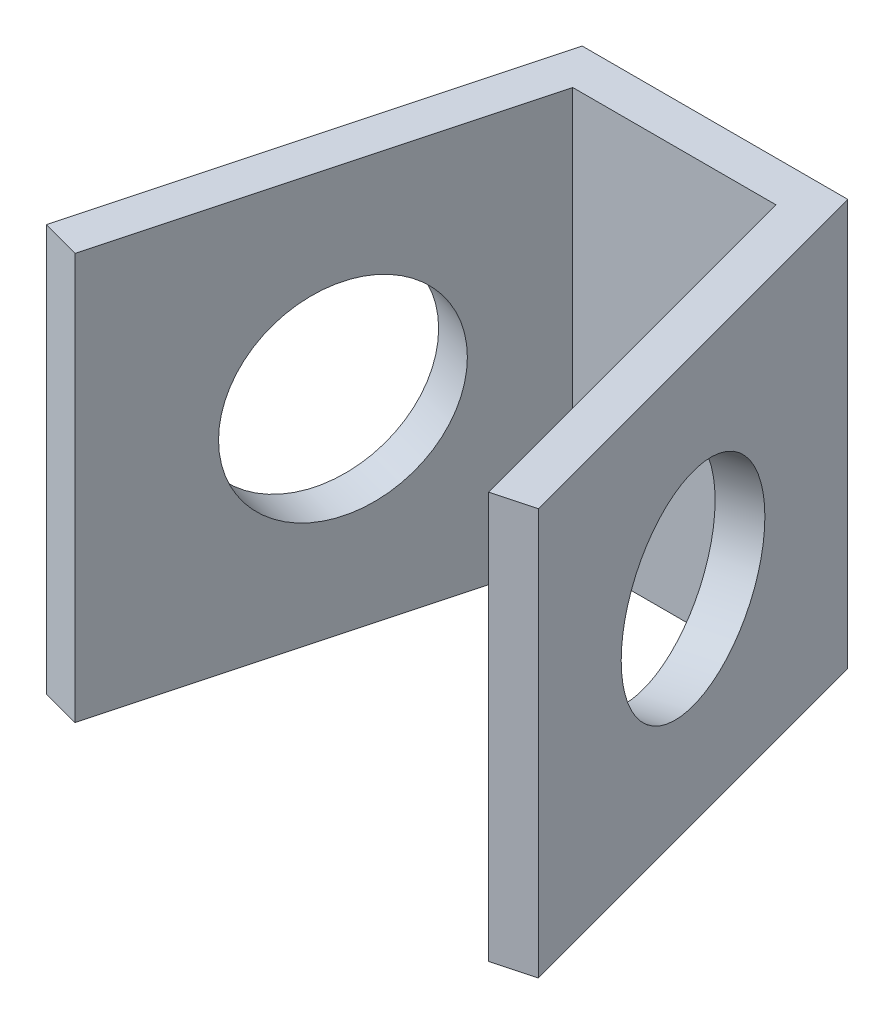
ISO-10303-21;
HEADER;
FILE_DESCRIPTION(('STEP AP214'),'2;1');
FILE_NAME('part.step','',(''),(''),'','','');
FILE_SCHEMA(('AUTOMOTIVE_DESIGN { 1 0 10303 214 1 1 1 1 }'));
ENDSEC;
DATA;
#1=APPLICATION_CONTEXT('core data for automotive mechanical design processes');
#2=APPLICATION_PROTOCOL_DEFINITION('international standard','automotive_design',2000,#1);
#3=PRODUCT_CONTEXT('',#1,'mechanical');
#4=PRODUCT('Part','Part','',(#3));
#5=PRODUCT_RELATED_PRODUCT_CATEGORY('part','',(#4));
#6=PRODUCT_DEFINITION_FORMATION('','',#4);
#7=PRODUCT_DEFINITION_CONTEXT('part definition',#1,'design');
#8=PRODUCT_DEFINITION('design','',#6,#7);
#9=PRODUCT_DEFINITION_SHAPE('','',#8);
#10=(LENGTH_UNIT() NAMED_UNIT(*) SI_UNIT(.MILLI.,.METRE.));
#11=(NAMED_UNIT(*) PLANE_ANGLE_UNIT() SI_UNIT($,.RADIAN.));
#12=(NAMED_UNIT(*) SI_UNIT($,.STERADIAN.) SOLID_ANGLE_UNIT());
#13=UNCERTAINTY_MEASURE_WITH_UNIT(LENGTH_MEASURE(1.E-05),#10,'distance_accuracy_value','');
#14=(GEOMETRIC_REPRESENTATION_CONTEXT(3) GLOBAL_UNCERTAINTY_ASSIGNED_CONTEXT((#13)) GLOBAL_UNIT_ASSIGNED_CONTEXT((#10,
#11,#12)) REPRESENTATION_CONTEXT('',''));
#15=CARTESIAN_POINT('',(0.,0.,0.));
#16=DIRECTION('',(0.,0.,1.));
#17=DIRECTION('',(1.,0.,0.));
#18=AXIS2_PLACEMENT_3D('',#15,#16,#17);
#19=CARTESIAN_POINT('',(-12.1082325546286,10.,18.8008784355763));
#20=DIRECTION('',(0.965925826289068,0.,0.258819045102521));
#21=DIRECTION('',(0.258819045102521,0.,-0.965925826289068));
#22=AXIS2_PLACEMENT_3D('',#19,#20,#21);
#23=PLANE('',#22);
#24=DIRECTION('',(-0.258819045102521,0.,0.965925826289068));
#25=VECTOR('',#24,1.);
#26=CARTESIAN_POINT('',(-12.1082325546286,-10.,18.8008784355763));
#27=LINE('',#26,#25);
#28=CARTESIAN_POINT('',(-6.53465397595792,-10.,-2.));
#29=VERTEX_POINT('',#28);
#30=CARTESIAN_POINT('',(-12.1082325546286,-10.,18.8008784355763));
#31=VERTEX_POINT('',#30);
#32=EDGE_CURVE('E122',#29,#31,#27,.T.);
#33=ORIENTED_EDGE('',*,*,#32,.T.);
#34=DIRECTION('',(0.,-1.,0.));
#35=VECTOR('',#34,1.);
#36=CARTESIAN_POINT('',(-12.1082325546286,10.,18.8008784355763));
#37=LINE('',#36,#35);
#38=CARTESIAN_POINT('',(-12.1082325546286,10.,18.8008784355763));
#39=VERTEX_POINT('',#38);
#40=EDGE_CURVE('E119',#39,#31,#37,.T.);
#41=ORIENTED_EDGE('',*,*,#40,.F.);
#42=DIRECTION('',(-0.258819045102521,0.,0.965925826289068));
#43=VECTOR('',#42,1.);
#44=CARTESIAN_POINT('',(-12.1082325546286,10.,18.8008784355763));
#45=LINE('',#44,#43);
#46=CARTESIAN_POINT('',(-6.53465397595792,10.,-2.));
#47=VERTEX_POINT('',#46);
#48=EDGE_CURVE('E108',#47,#39,#45,.T.);
#49=ORIENTED_EDGE('',*,*,#48,.F.);
#50=DIRECTION('',(0.,-1.,0.));
#51=VECTOR('',#50,1.);
#52=CARTESIAN_POINT('',(-6.53465397595792,10.,-2.));
#53=LINE('',#52,#51);
#54=EDGE_CURVE('E123',#47,#29,#53,.T.);
#55=ORIENTED_EDGE('',*,*,#54,.T.);
#56=EDGE_LOOP('',(#33,#41,#49,#55));
#57=FACE_BOUND('',#56,.T.);
#58=CARTESIAN_POINT('',(-9.32144326529324,0.,8.40043921778816));
#59=DIRECTION('',(0.965925826289068,0.,0.258819045102521));
#60=DIRECTION('',(0.258819045102521,0.,-0.965925826289068));
#61=AXIS2_PLACEMENT_3D('',#58,#59,#60);
#62=CIRCLE('',#61,5.);
#63=CARTESIAN_POINT('',(-8.02734803978064,0.,3.57081008634282));
#64=VERTEX_POINT('',#63);
#65=EDGE_CURVE('E186',#64,#64,#62,.T.);
#66=ORIENTED_EDGE('',*,*,#65,.T.);
#67=EDGE_LOOP('',(#66));
#68=FACE_BOUND('',#67,.T.);
#69=ADVANCED_FACE('F35',(#57,#68),#23,.F.);
#70=CARTESIAN_POINT('',(-5.,10.,0.));
#71=DIRECTION('',(-0.965925826289068,0.,-0.258819045102521));
#72=DIRECTION('',(-0.258819045102521,0.,0.965925826289068));
#73=AXIS2_PLACEMENT_3D('',#70,#71,#72);
#74=PLANE('',#73);
#75=DIRECTION('',(0.258819045102521,0.,-0.965925826289068));
#76=VECTOR('',#75,1.);
#77=CARTESIAN_POINT('',(-5.,-10.,0.));
#78=LINE('',#77,#76);
#79=CARTESIAN_POINT('',(-10.1763809020504,-10.,19.3185165257814));
#80=VERTEX_POINT('',#79);
#81=CARTESIAN_POINT('',(-5.,-10.,0.));
#82=VERTEX_POINT('',#81);
#83=EDGE_CURVE('E87',#80,#82,#78,.T.);
#84=ORIENTED_EDGE('',*,*,#83,.T.);
#85=DIRECTION('',(0.,-1.,0.));
#86=VECTOR('',#85,1.);
#87=CARTESIAN_POINT('',(-5.,10.,0.));
#88=LINE('',#87,#86);
#89=CARTESIAN_POINT('',(-5.,10.,0.));
#90=VERTEX_POINT('',#89);
#91=EDGE_CURVE('E128',#90,#82,#88,.T.);
#92=ORIENTED_EDGE('',*,*,#91,.F.);
#93=DIRECTION('',(0.258819045102521,0.,-0.965925826289068));
#94=VECTOR('',#93,1.);
#95=CARTESIAN_POINT('',(-5.,10.,0.));
#96=LINE('',#95,#94);
#97=CARTESIAN_POINT('',(-10.1763809020504,10.,19.3185165257814));
#98=VERTEX_POINT('',#97);
#99=EDGE_CURVE('E52',#98,#90,#96,.T.);
#100=ORIENTED_EDGE('',*,*,#99,.F.);
#101=DIRECTION('',(0.,-1.,0.));
#102=VECTOR('',#101,1.);
#103=CARTESIAN_POINT('',(-10.1763809020504,10.,19.3185165257814));
#104=LINE('',#103,#102);
#105=EDGE_CURVE('E124',#98,#80,#104,.T.);
#106=ORIENTED_EDGE('',*,*,#105,.T.);
#107=EDGE_LOOP('',(#84,#92,#100,#106));
#108=FACE_BOUND('',#107,.T.);
#109=CARTESIAN_POINT('',(-7.38959161271511,0.,8.9180773079932));
#110=DIRECTION('',(-0.965925826289068,0.,-0.258819045102521));
#111=DIRECTION('',(-0.258819045102521,0.,0.965925826289068));
#112=AXIS2_PLACEMENT_3D('',#109,#110,#111);
#113=CIRCLE('',#112,5.);
#114=CARTESIAN_POINT('',(-8.68368683822771,0.,13.7477064394385));
#115=VERTEX_POINT('',#114);
#116=EDGE_CURVE('E183',#115,#115,#113,.T.);
#117=ORIENTED_EDGE('',*,*,#116,.T.);
#118=EDGE_LOOP('',(#117));
#119=FACE_BOUND('',#118,.T.);
#120=ADVANCED_FACE('F192',(#108,#119),#74,.F.);
#121=CARTESIAN_POINT('',(-5.,10.,0.));
#122=DIRECTION('',(0.,0.,-1.));
#123=DIRECTION('',(-1.,0.,0.));
#124=AXIS2_PLACEMENT_3D('',#121,#122,#123);
#125=PLANE('',#124);
#126=DIRECTION('',(1.,0.,0.));
#127=VECTOR('',#126,1.);
#128=CARTESIAN_POINT('',(-5.,-10.,0.));
#129=LINE('',#128,#127);
#130=CARTESIAN_POINT('',(5.,-10.,0.));
#131=VERTEX_POINT('',#130);
#132=EDGE_CURVE('E132',#82,#131,#129,.T.);
#133=ORIENTED_EDGE('',*,*,#132,.T.);
#134=DIRECTION('',(0.,-1.,0.));
#135=VECTOR('',#134,1.);
#136=CARTESIAN_POINT('',(5.,10.,0.));
#137=LINE('',#136,#135);
#138=CARTESIAN_POINT('',(5.,10.,0.));
#139=VERTEX_POINT('',#138);
#140=EDGE_CURVE('E11',#139,#131,#137,.T.);
#141=ORIENTED_EDGE('',*,*,#140,.F.);
#142=DIRECTION('',(1.,0.,0.));
#143=VECTOR('',#142,1.);
#144=CARTESIAN_POINT('',(-5.,10.,0.));
#145=LINE('',#144,#143);
#146=EDGE_CURVE('E147',#90,#139,#145,.T.);
#147=ORIENTED_EDGE('',*,*,#146,.F.);
#148=ORIENTED_EDGE('',*,*,#91,.T.);
#149=EDGE_LOOP('',(#133,#141,#147,#148));
#150=FACE_BOUND('',#149,.T.);
#151=ADVANCED_FACE('F37',(#150),#125,.F.);
#152=CARTESIAN_POINT('',(5.,10.,0.));
#153=DIRECTION('',(0.965925826289068,0.,-0.258819045102522));
#154=DIRECTION('',(-0.258819045102522,0.,-0.965925826289068));
#155=AXIS2_PLACEMENT_3D('',#152,#153,#154);
#156=PLANE('',#155);
#157=CARTESIAN_POINT('',(7.38959161271511,0.,8.9180773079932));
#158=DIRECTION('',(0.965925826289068,0.,-0.258819045102522));
#159=DIRECTION('',(-0.258819045102522,0.,-0.965925826289068));
#160=AXIS2_PLACEMENT_3D('',#157,#158,#159);
#161=CIRCLE('',#160,5.);
#162=CARTESIAN_POINT('',(6.0954963872025,0.,4.08844817654786));
#163=VERTEX_POINT('',#162);
#164=EDGE_CURVE('E136',#163,#163,#161,.F.);
#165=ORIENTED_EDGE('',*,*,#164,.F.);
#166=EDGE_LOOP('',(#165));
#167=FACE_BOUND('',#166,.T.);
#168=DIRECTION('',(0.258819045102522,0.,0.965925826289068));
#169=VECTOR('',#168,1.);
#170=CARTESIAN_POINT('',(5.,-10.,0.));
#171=LINE('',#170,#169);
#172=CARTESIAN_POINT('',(10.1763809020504,-10.,19.3185165257814));
#173=VERTEX_POINT('',#172);
#174=EDGE_CURVE('E135',#131,#173,#171,.T.);
#175=ORIENTED_EDGE('',*,*,#174,.T.);
#176=DIRECTION('',(0.,-1.,0.));
#177=VECTOR('',#176,1.);
#178=CARTESIAN_POINT('',(10.1763809020504,10.,19.3185165257814));
#179=LINE('',#178,#177);
#180=CARTESIAN_POINT('',(10.1763809020504,10.,19.3185165257814));
#181=VERTEX_POINT('',#180);
#182=EDGE_CURVE('E44',#181,#173,#179,.T.);
#183=ORIENTED_EDGE('',*,*,#182,.F.);
#184=DIRECTION('',(0.258819045102522,0.,0.965925826289068));
#185=VECTOR('',#184,1.);
#186=CARTESIAN_POINT('',(5.,10.,0.));
#187=LINE('',#186,#185);
#188=EDGE_CURVE('E95',#139,#181,#187,.T.);
#189=ORIENTED_EDGE('',*,*,#188,.F.);
#190=ORIENTED_EDGE('',*,*,#140,.T.);
#191=EDGE_LOOP('',(#175,#183,#189,#190));
#192=FACE_BOUND('',#191,.T.);
#193=ADVANCED_FACE('F220',(#167,#192),#156,.F.);
#194=CARTESIAN_POINT('',(10.1763809020504,10.,19.3185165257814));
#195=DIRECTION('',(-0.258819045102523,0.,-0.965925826289068));
#196=DIRECTION('',(-0.965925826289068,0.,0.258819045102524));
#197=AXIS2_PLACEMENT_3D('',#194,#195,#196);
#198=PLANE('',#197);
#199=DIRECTION('',(0.965925826289068,0.,-0.258819045102523));
#200=VECTOR('',#199,1.);
#201=CARTESIAN_POINT('',(10.1763809020504,-10.,19.3185165257814));
#202=LINE('',#201,#200);
#203=CARTESIAN_POINT('',(12.1082325546286,-10.,18.8008784355763));
#204=VERTEX_POINT('',#203);
#205=EDGE_CURVE('E138',#173,#204,#202,.T.);
#206=ORIENTED_EDGE('',*,*,#205,.T.);
#207=DIRECTION('',(0.,-1.,0.));
#208=VECTOR('',#207,1.);
#209=CARTESIAN_POINT('',(12.1082325546286,10.,18.8008784355763));
#210=LINE('',#209,#208);
#211=CARTESIAN_POINT('',(12.1082325546286,10.,18.8008784355763));
#212=VERTEX_POINT('',#211);
#213=EDGE_CURVE('E154',#212,#204,#210,.T.);
#214=ORIENTED_EDGE('',*,*,#213,.F.);
#215=DIRECTION('',(0.965925826289068,0.,-0.258819045102523));
#216=VECTOR('',#215,1.);
#217=CARTESIAN_POINT('',(10.1763809020504,10.,19.3185165257814));
#218=LINE('',#217,#216);
#219=EDGE_CURVE('E162',#181,#212,#218,.T.);
#220=ORIENTED_EDGE('',*,*,#219,.F.);
#221=ORIENTED_EDGE('',*,*,#182,.T.);
#222=EDGE_LOOP('',(#206,#214,#220,#221));
#223=FACE_BOUND('',#222,.T.);
#224=ADVANCED_FACE('F160',(#223),#198,.F.);
#225=CARTESIAN_POINT('',(12.1082325546286,10.,18.8008784355763));
#226=DIRECTION('',(-0.965925826289068,0.,0.258819045102521));
#227=DIRECTION('',(0.258819045102521,0.,0.965925826289068));
#228=AXIS2_PLACEMENT_3D('',#225,#226,#227);
#229=PLANE('',#228);
#230=CARTESIAN_POINT('',(9.32144326529324,0.,8.40043921778816));
#231=DIRECTION('',(0.965925826289068,0.,-0.258819045102521));
#232=DIRECTION('',(-0.258819045102521,0.,-0.965925826289068));
#233=AXIS2_PLACEMENT_3D('',#230,#231,#232);
#234=CIRCLE('',#233,5.);
#235=CARTESIAN_POINT('',(8.02734803978064,0.,3.57081008634282));
#236=VERTEX_POINT('',#235);
#237=EDGE_CURVE('E180',#236,#236,#234,.T.);
#238=ORIENTED_EDGE('',*,*,#237,.F.);
#239=EDGE_LOOP('',(#238));
#240=FACE_BOUND('',#239,.T.);
#241=DIRECTION('',(-0.258819045102521,0.,-0.965925826289068));
#242=VECTOR('',#241,1.);
#243=CARTESIAN_POINT('',(12.1082325546286,-10.,18.8008784355763));
#244=LINE('',#243,#242);
#245=CARTESIAN_POINT('',(6.53465397595792,-10.,-2.));
#246=VERTEX_POINT('',#245);
#247=EDGE_CURVE('E140',#204,#246,#244,.T.);
#248=ORIENTED_EDGE('',*,*,#247,.T.);
#249=DIRECTION('',(0.,-1.,0.));
#250=VECTOR('',#249,1.);
#251=CARTESIAN_POINT('',(6.53465397595792,10.,-2.));
#252=LINE('',#251,#250);
#253=CARTESIAN_POINT('',(6.53465397595792,10.,-2.));
#254=VERTEX_POINT('',#253);
#255=EDGE_CURVE('E151',#254,#246,#252,.T.);
#256=ORIENTED_EDGE('',*,*,#255,.F.);
#257=DIRECTION('',(-0.258819045102521,0.,-0.965925826289068));
#258=VECTOR('',#257,1.);
#259=CARTESIAN_POINT('',(12.1082325546286,10.,18.8008784355763));
#260=LINE('',#259,#258);
#261=EDGE_CURVE('E174',#212,#254,#260,.T.);
#262=ORIENTED_EDGE('',*,*,#261,.F.);
#263=ORIENTED_EDGE('',*,*,#213,.T.);
#264=EDGE_LOOP('',(#248,#256,#262,#263));
#265=FACE_BOUND('',#264,.T.);
#266=ADVANCED_FACE('F170',(#240,#265),#229,.F.);
#267=CARTESIAN_POINT('',(-6.53465397595792,10.,-2.));
#268=DIRECTION('',(0.,0.,1.));
#269=DIRECTION('',(1.,0.,0.));
#270=AXIS2_PLACEMENT_3D('',#267,#268,#269);
#271=PLANE('',#270);
#272=DIRECTION('',(-1.,0.,0.));
#273=VECTOR('',#272,1.);
#274=CARTESIAN_POINT('',(-6.53465397595792,-10.,-2.));
#275=LINE('',#274,#273);
#276=EDGE_CURVE('E142',#246,#29,#275,.T.);
#277=ORIENTED_EDGE('',*,*,#276,.T.);
#278=ORIENTED_EDGE('',*,*,#54,.F.);
#279=DIRECTION('',(-1.,0.,0.));
#280=VECTOR('',#279,1.);
#281=CARTESIAN_POINT('',(-6.53465397595792,10.,-2.));
#282=LINE('',#281,#280);
#283=EDGE_CURVE('E114',#254,#47,#282,.T.);
#284=ORIENTED_EDGE('',*,*,#283,.F.);
#285=ORIENTED_EDGE('',*,*,#255,.T.);
#286=EDGE_LOOP('',(#277,#278,#284,#285));
#287=FACE_BOUND('',#286,.T.);
#288=ADVANCED_FACE('F173',(#287),#271,.F.);
#289=CARTESIAN_POINT('',(-10.1763809020504,10.,19.3185165257814));
#290=DIRECTION('',(0.258819045102523,0.,-0.965925826289068));
#291=DIRECTION('',(-0.965925826289068,0.,-0.258819045102523));
#292=AXIS2_PLACEMENT_3D('',#289,#290,#291);
#293=PLANE('',#292);
#294=DIRECTION('',(0.965925826289068,0.,0.258819045102523));
#295=VECTOR('',#294,1.);
#296=CARTESIAN_POINT('',(-10.1763809020504,-10.,19.3185165257814));
#297=LINE('',#296,#295);
#298=EDGE_CURVE('E81',#31,#80,#297,.T.);
#299=ORIENTED_EDGE('',*,*,#298,.T.);
#300=ORIENTED_EDGE('',*,*,#105,.F.);
#301=DIRECTION('',(0.965925826289068,0.,0.258819045102523));
#302=VECTOR('',#301,1.);
#303=CARTESIAN_POINT('',(-10.1763809020504,10.,19.3185165257814));
#304=LINE('',#303,#302);
#305=EDGE_CURVE('E112',#39,#98,#304,.T.);
#306=ORIENTED_EDGE('',*,*,#305,.F.);
#307=ORIENTED_EDGE('',*,*,#40,.T.);
#308=EDGE_LOOP('',(#299,#300,#306,#307));
#309=FACE_BOUND('',#308,.T.);
#310=ADVANCED_FACE('F126',(#309),#293,.F.);
#311=CARTESIAN_POINT('',(0.,10.,0.));
#312=DIRECTION('',(0.,-1.,0.));
#313=DIRECTION('',(0.,0.,-1.));
#314=AXIS2_PLACEMENT_3D('',#311,#312,#313);
#315=PLANE('',#314);
#316=ORIENTED_EDGE('',*,*,#146,.T.);
#317=ORIENTED_EDGE('',*,*,#188,.T.);
#318=ORIENTED_EDGE('',*,*,#219,.T.);
#319=ORIENTED_EDGE('',*,*,#261,.T.);
#320=ORIENTED_EDGE('',*,*,#283,.T.);
#321=ORIENTED_EDGE('',*,*,#48,.T.);
#322=ORIENTED_EDGE('',*,*,#305,.T.);
#323=ORIENTED_EDGE('',*,*,#99,.T.);
#324=EDGE_LOOP('',(#316,#317,#318,#319,#320,#321,#322,#323));
#325=FACE_BOUND('',#324,.T.);
#326=ADVANCED_FACE('F110',(#325),#315,.F.);
#327=CARTESIAN_POINT('',(0.,-10.,0.));
#328=DIRECTION('',(0.,-1.,0.));
#329=DIRECTION('',(0.,0.,-1.));
#330=AXIS2_PLACEMENT_3D('',#327,#328,#329);
#331=PLANE('',#330);
#332=ORIENTED_EDGE('',*,*,#132,.F.);
#333=ORIENTED_EDGE('',*,*,#83,.F.);
#334=ORIENTED_EDGE('',*,*,#298,.F.);
#335=ORIENTED_EDGE('',*,*,#32,.F.);
#336=ORIENTED_EDGE('',*,*,#276,.F.);
#337=ORIENTED_EDGE('',*,*,#247,.F.);
#338=ORIENTED_EDGE('',*,*,#205,.F.);
#339=ORIENTED_EDGE('',*,*,#174,.F.);
#340=EDGE_LOOP('',(#332,#333,#334,#335,#336,#337,#338,#339));
#341=FACE_BOUND('',#340,.T.);
#342=ADVANCED_FACE('F166',(#341),#331,.T.);
#343=CARTESIAN_POINT('',(-13.4034188118266,0.,14.4895476594611));
#344=DIRECTION('',(0.965925826289068,0.,-0.258819045102521));
#345=DIRECTION('',(-0.258819045102521,0.,-0.965925826289068));
#346=AXIS2_PLACEMENT_3D('',#343,#344,#345);
#347=CYLINDRICAL_SURFACE('',#346,5.);
#348=ORIENTED_EDGE('',*,*,#237,.T.);
#349=EDGE_LOOP('',(#348));
#350=FACE_BOUND('',#349,.T.);
#351=ORIENTED_EDGE('',*,*,#164,.T.);
#352=EDGE_LOOP('',(#351));
#353=FACE_BOUND('',#352,.T.);
#354=ADVANCED_FACE('F196',(#350,#353),#347,.F.);
#355=CARTESIAN_POINT('',(13.4034188118266,0.,14.4895476594611));
#356=DIRECTION('',(-0.965925826289068,0.,-0.258819045102521));
#357=DIRECTION('',(-0.258819045102521,0.,0.965925826289068));
#358=AXIS2_PLACEMENT_3D('',#355,#356,#357);
#359=CYLINDRICAL_SURFACE('',#358,5.);
#360=ORIENTED_EDGE('',*,*,#65,.F.);
#361=EDGE_LOOP('',(#360));
#362=FACE_BOUND('',#361,.T.);
#363=ORIENTED_EDGE('',*,*,#116,.F.);
#364=EDGE_LOOP('',(#363));
#365=FACE_BOUND('',#364,.T.);
#366=ADVANCED_FACE('F194',(#362,#365),#359,.F.);
#367=CLOSED_SHELL('',(#69,#120,#151,#193,#224,#266,#288,#310,#326,#342,#354,#366));
#368=MANIFOLD_SOLID_BREP('B2',#367);
#369=ADVANCED_BREP_SHAPE_REPRESENTATION('',(#18,#368),#14);
#370=SHAPE_DEFINITION_REPRESENTATION(#9,#369);
ENDSEC;
END-ISO-10303-21;
